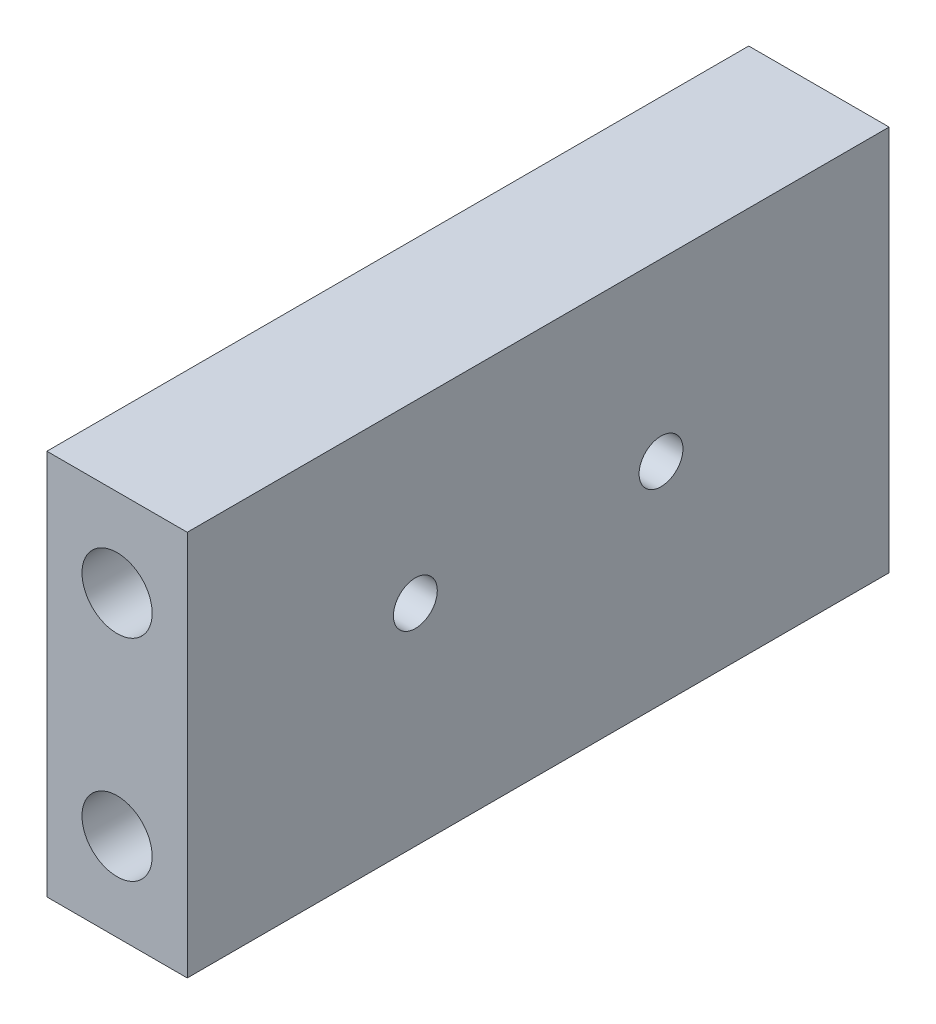
ISO-10303-21;
HEADER;
FILE_DESCRIPTION(('STEP AP214'),'2;1');
FILE_NAME('part.step','',(''),(''),'','','');
FILE_SCHEMA(('AUTOMOTIVE_DESIGN { 1 0 10303 214 1 1 1 1 }'));
ENDSEC;
DATA;
#1=APPLICATION_CONTEXT('core data for automotive mechanical design processes');
#2=APPLICATION_PROTOCOL_DEFINITION('international standard','automotive_design',2000,#1);
#3=PRODUCT_CONTEXT('',#1,'mechanical');
#4=PRODUCT('Part','Part','',(#3));
#5=PRODUCT_RELATED_PRODUCT_CATEGORY('part','',(#4));
#6=PRODUCT_DEFINITION_FORMATION('','',#4);
#7=PRODUCT_DEFINITION_CONTEXT('part definition',#1,'design');
#8=PRODUCT_DEFINITION('design','',#6,#7);
#9=PRODUCT_DEFINITION_SHAPE('','',#8);
#10=(LENGTH_UNIT() NAMED_UNIT(*) SI_UNIT(.MILLI.,.METRE.));
#11=(NAMED_UNIT(*) PLANE_ANGLE_UNIT() SI_UNIT($,.RADIAN.));
#12=(NAMED_UNIT(*) SI_UNIT($,.STERADIAN.) SOLID_ANGLE_UNIT());
#13=UNCERTAINTY_MEASURE_WITH_UNIT(LENGTH_MEASURE(1.E-05),#10,'distance_accuracy_value','');
#14=(GEOMETRIC_REPRESENTATION_CONTEXT(3) GLOBAL_UNCERTAINTY_ASSIGNED_CONTEXT((#13)) GLOBAL_UNIT_ASSIGNED_CONTEXT((#10,
#11,#12)) REPRESENTATION_CONTEXT('',''));
#15=CARTESIAN_POINT('',(0.,0.,0.));
#16=DIRECTION('',(0.,0.,1.));
#17=DIRECTION('',(1.,0.,0.));
#18=AXIS2_PLACEMENT_3D('',#15,#16,#17);
#19=CARTESIAN_POINT('',(25.4,-34.925,-63.5));
#20=DIRECTION('',(0.,0.,1.));
#21=DIRECTION('',(1.,0.,0.));
#22=AXIS2_PLACEMENT_3D('',#19,#20,#21);
#23=PLANE('',#22);
#24=CARTESIAN_POINT('',(12.7,19.05,-63.5));
#25=DIRECTION('',(0.,0.,1.));
#26=DIRECTION('',(1.,0.,0.));
#27=AXIS2_PLACEMENT_3D('',#24,#25,#26);
#28=CIRCLE('',#27,6.35);
#29=CARTESIAN_POINT('',(19.05,19.05,-63.5));
#30=VERTEX_POINT('',#29);
#31=EDGE_CURVE('E127',#30,#30,#28,.T.);
#32=ORIENTED_EDGE('',*,*,#31,.T.);
#33=EDGE_LOOP('',(#32));
#34=FACE_BOUND('',#33,.T.);
#35=DIRECTION('',(0.,1.,0.));
#36=VECTOR('',#35,1.);
#37=CARTESIAN_POINT('',(0.,-34.925,-63.5));
#38=LINE('',#37,#36);
#39=CARTESIAN_POINT('',(0.,-34.925,-63.5));
#40=VERTEX_POINT('',#39);
#41=CARTESIAN_POINT('',(0.,34.925,-63.5));
#42=VERTEX_POINT('',#41);
#43=EDGE_CURVE('E71',#40,#42,#38,.T.);
#44=ORIENTED_EDGE('',*,*,#43,.T.);
#45=DIRECTION('',(-1.,0.,0.));
#46=VECTOR('',#45,1.);
#47=CARTESIAN_POINT('',(25.4,34.925,-63.5));
#48=LINE('',#47,#46);
#49=CARTESIAN_POINT('',(25.4,34.925,-63.5));
#50=VERTEX_POINT('',#49);
#51=EDGE_CURVE('E94',#50,#42,#48,.T.);
#52=ORIENTED_EDGE('',*,*,#51,.F.);
#53=DIRECTION('',(0.,1.,0.));
#54=VECTOR('',#53,1.);
#55=CARTESIAN_POINT('',(25.4,-34.925,-63.5));
#56=LINE('',#55,#54);
#57=CARTESIAN_POINT('',(25.4,-34.925,-63.5));
#58=VERTEX_POINT('',#57);
#59=EDGE_CURVE('E87',#58,#50,#56,.T.);
#60=ORIENTED_EDGE('',*,*,#59,.F.);
#61=DIRECTION('',(-1.,0.,0.));
#62=VECTOR('',#61,1.);
#63=CARTESIAN_POINT('',(25.4,-34.925,-63.5));
#64=LINE('',#63,#62);
#65=EDGE_CURVE('E46',#58,#40,#64,.T.);
#66=ORIENTED_EDGE('',*,*,#65,.T.);
#67=EDGE_LOOP('',(#44,#52,#60,#66));
#68=FACE_BOUND('',#67,.T.);
#69=CARTESIAN_POINT('',(12.7,-19.05,-63.5));
#70=DIRECTION('',(0.,0.,1.));
#71=DIRECTION('',(1.,0.,0.));
#72=AXIS2_PLACEMENT_3D('',#69,#70,#71);
#73=CIRCLE('',#72,6.35);
#74=CARTESIAN_POINT('',(19.05,-19.05,-63.5));
#75=VERTEX_POINT('',#74);
#76=EDGE_CURVE('E133',#75,#75,#73,.T.);
#77=ORIENTED_EDGE('',*,*,#76,.T.);
#78=EDGE_LOOP('',(#77));
#79=FACE_BOUND('',#78,.T.);
#80=ADVANCED_FACE('F37',(#34,#68,#79),#23,.F.);
#81=CARTESIAN_POINT('',(25.4,-34.925,63.5));
#82=DIRECTION('',(0.,0.,-1.));
#83=DIRECTION('',(-1.,0.,0.));
#84=AXIS2_PLACEMENT_3D('',#81,#82,#83);
#85=PLANE('',#84);
#86=CARTESIAN_POINT('',(12.7,-19.05,63.5));
#87=DIRECTION('',(0.,0.,1.));
#88=DIRECTION('',(1.,0.,0.));
#89=AXIS2_PLACEMENT_3D('',#86,#87,#88);
#90=CIRCLE('',#89,6.35);
#91=CARTESIAN_POINT('',(19.05,-19.05,63.5));
#92=VERTEX_POINT('',#91);
#93=EDGE_CURVE('E118',#92,#92,#90,.T.);
#94=ORIENTED_EDGE('',*,*,#93,.F.);
#95=EDGE_LOOP('',(#94));
#96=FACE_BOUND('',#95,.T.);
#97=CARTESIAN_POINT('',(12.7,19.05,63.5));
#98=DIRECTION('',(0.,0.,1.));
#99=DIRECTION('',(1.,0.,0.));
#100=AXIS2_PLACEMENT_3D('',#97,#98,#99);
#101=CIRCLE('',#100,6.35);
#102=CARTESIAN_POINT('',(19.05,19.05,63.5));
#103=VERTEX_POINT('',#102);
#104=EDGE_CURVE('E115',#103,#103,#101,.T.);
#105=ORIENTED_EDGE('',*,*,#104,.F.);
#106=EDGE_LOOP('',(#105));
#107=FACE_BOUND('',#106,.T.);
#108=DIRECTION('',(0.,-1.,0.));
#109=VECTOR('',#108,1.);
#110=CARTESIAN_POINT('',(0.,-34.925,63.5));
#111=LINE('',#110,#109);
#112=CARTESIAN_POINT('',(0.,34.925,63.5));
#113=VERTEX_POINT('',#112);
#114=CARTESIAN_POINT('',(0.,-34.925,63.5));
#115=VERTEX_POINT('',#114);
#116=EDGE_CURVE('E101',#113,#115,#111,.T.);
#117=ORIENTED_EDGE('',*,*,#116,.T.);
#118=DIRECTION('',(-1.,0.,0.));
#119=VECTOR('',#118,1.);
#120=CARTESIAN_POINT('',(25.4,-34.925,63.5));
#121=LINE('',#120,#119);
#122=CARTESIAN_POINT('',(25.4,-34.925,63.5));
#123=VERTEX_POINT('',#122);
#124=EDGE_CURVE('E11',#123,#115,#121,.T.);
#125=ORIENTED_EDGE('',*,*,#124,.F.);
#126=DIRECTION('',(0.,-1.,0.));
#127=VECTOR('',#126,1.);
#128=CARTESIAN_POINT('',(25.4,-34.925,63.5));
#129=LINE('',#128,#127);
#130=CARTESIAN_POINT('',(25.4,34.925,63.5));
#131=VERTEX_POINT('',#130);
#132=EDGE_CURVE('E89',#131,#123,#129,.T.);
#133=ORIENTED_EDGE('',*,*,#132,.F.);
#134=DIRECTION('',(-1.,0.,0.));
#135=VECTOR('',#134,1.);
#136=CARTESIAN_POINT('',(25.4,34.925,63.5));
#137=LINE('',#136,#135);
#138=EDGE_CURVE('E97',#131,#113,#137,.T.);
#139=ORIENTED_EDGE('',*,*,#138,.T.);
#140=EDGE_LOOP('',(#117,#125,#133,#139));
#141=FACE_BOUND('',#140,.T.);
#142=ADVANCED_FACE('F39',(#96,#107,#141),#85,.F.);
#143=CARTESIAN_POINT('',(25.4,-34.925,-63.5));
#144=DIRECTION('',(0.,1.,0.));
#145=DIRECTION('',(0.,0.,1.));
#146=AXIS2_PLACEMENT_3D('',#143,#144,#145);
#147=PLANE('',#146);
#148=DIRECTION('',(0.,0.,-1.));
#149=VECTOR('',#148,1.);
#150=CARTESIAN_POINT('',(0.,-34.925,-63.5));
#151=LINE('',#150,#149);
#152=EDGE_CURVE('E93',#115,#40,#151,.T.);
#153=ORIENTED_EDGE('',*,*,#152,.T.);
#154=ORIENTED_EDGE('',*,*,#65,.F.);
#155=DIRECTION('',(0.,0.,-1.));
#156=VECTOR('',#155,1.);
#157=CARTESIAN_POINT('',(25.4,-34.925,-63.5));
#158=LINE('',#157,#156);
#159=EDGE_CURVE('E84',#123,#58,#158,.T.);
#160=ORIENTED_EDGE('',*,*,#159,.F.);
#161=ORIENTED_EDGE('',*,*,#124,.T.);
#162=EDGE_LOOP('',(#153,#154,#160,#161));
#163=FACE_BOUND('',#162,.T.);
#164=ADVANCED_FACE('F92',(#163),#147,.F.);
#165=CARTESIAN_POINT('',(25.4,34.925,-63.5));
#166=DIRECTION('',(0.,-1.,0.));
#167=DIRECTION('',(0.,0.,-1.));
#168=AXIS2_PLACEMENT_3D('',#165,#166,#167);
#169=PLANE('',#168);
#170=DIRECTION('',(0.,0.,1.));
#171=VECTOR('',#170,1.);
#172=CARTESIAN_POINT('',(0.,34.925,-63.5));
#173=LINE('',#172,#171);
#174=EDGE_CURVE('E77',#42,#113,#173,.T.);
#175=ORIENTED_EDGE('',*,*,#174,.T.);
#176=ORIENTED_EDGE('',*,*,#138,.F.);
#177=DIRECTION('',(0.,0.,1.));
#178=VECTOR('',#177,1.);
#179=CARTESIAN_POINT('',(25.4,34.925,-63.5));
#180=LINE('',#179,#178);
#181=EDGE_CURVE('E54',#50,#131,#180,.T.);
#182=ORIENTED_EDGE('',*,*,#181,.F.);
#183=ORIENTED_EDGE('',*,*,#51,.T.);
#184=EDGE_LOOP('',(#175,#176,#182,#183));
#185=FACE_BOUND('',#184,.T.);
#186=ADVANCED_FACE('F109',(#185),#169,.F.);
#187=CARTESIAN_POINT('',(25.4,0.,0.));
#188=DIRECTION('',(1.,0.,0.));
#189=DIRECTION('',(0.,0.,-1.));
#190=AXIS2_PLACEMENT_3D('',#187,#188,#189);
#191=PLANE('',#190);
#192=CARTESIAN_POINT('',(25.4,3.17500000000003,-22.225));
#193=DIRECTION('',(1.,0.,0.));
#194=DIRECTION('',(0.,0.,-1.));
#195=AXIS2_PLACEMENT_3D('',#192,#193,#194);
#196=CIRCLE('',#195,3.96875);
#197=CARTESIAN_POINT('',(25.4,3.17500000000003,-26.19375));
#198=VERTEX_POINT('',#197);
#199=EDGE_CURVE('E145',#198,#198,#196,.T.);
#200=ORIENTED_EDGE('',*,*,#199,.F.);
#201=EDGE_LOOP('',(#200));
#202=FACE_BOUND('',#201,.T.);
#203=CARTESIAN_POINT('',(25.4,3.17500000000001,22.225));
#204=DIRECTION('',(1.,0.,0.));
#205=DIRECTION('',(0.,0.,-1.));
#206=AXIS2_PLACEMENT_3D('',#203,#204,#205);
#207=CIRCLE('',#206,3.96875);
#208=CARTESIAN_POINT('',(25.4,3.17500000000001,18.25625));
#209=VERTEX_POINT('',#208);
#210=EDGE_CURVE('E139',#209,#209,#207,.T.);
#211=ORIENTED_EDGE('',*,*,#210,.F.);
#212=EDGE_LOOP('',(#211));
#213=FACE_BOUND('',#212,.T.);
#214=ORIENTED_EDGE('',*,*,#132,.T.);
#215=ORIENTED_EDGE('',*,*,#159,.T.);
#216=ORIENTED_EDGE('',*,*,#59,.T.);
#217=ORIENTED_EDGE('',*,*,#181,.T.);
#218=EDGE_LOOP('',(#214,#215,#216,#217));
#219=FACE_BOUND('',#218,.T.);
#220=ADVANCED_FACE('F85',(#202,#213,#219),#191,.T.);
#221=CARTESIAN_POINT('',(0.,0.,0.));
#222=DIRECTION('',(1.,0.,0.));
#223=DIRECTION('',(0.,0.,-1.));
#224=AXIS2_PLACEMENT_3D('',#221,#222,#223);
#225=PLANE('',#224);
#226=CARTESIAN_POINT('',(0.,3.17500000000003,-22.225));
#227=DIRECTION('',(1.,0.,0.));
#228=DIRECTION('',(0.,0.,-1.));
#229=AXIS2_PLACEMENT_3D('',#226,#227,#228);
#230=CIRCLE('',#229,3.96875);
#231=CARTESIAN_POINT('',(0.,3.17500000000003,-26.19375));
#232=VERTEX_POINT('',#231);
#233=EDGE_CURVE('E142',#232,#232,#230,.T.);
#234=ORIENTED_EDGE('',*,*,#233,.T.);
#235=EDGE_LOOP('',(#234));
#236=FACE_BOUND('',#235,.T.);
#237=CARTESIAN_POINT('',(0.,3.17500000000001,22.225));
#238=DIRECTION('',(1.,0.,0.));
#239=DIRECTION('',(0.,0.,-1.));
#240=AXIS2_PLACEMENT_3D('',#237,#238,#239);
#241=CIRCLE('',#240,3.96875);
#242=CARTESIAN_POINT('',(0.,3.17500000000001,18.25625));
#243=VERTEX_POINT('',#242);
#244=EDGE_CURVE('E136',#243,#243,#241,.T.);
#245=ORIENTED_EDGE('',*,*,#244,.T.);
#246=EDGE_LOOP('',(#245));
#247=FACE_BOUND('',#246,.T.);
#248=ORIENTED_EDGE('',*,*,#116,.F.);
#249=ORIENTED_EDGE('',*,*,#174,.F.);
#250=ORIENTED_EDGE('',*,*,#43,.F.);
#251=ORIENTED_EDGE('',*,*,#152,.F.);
#252=EDGE_LOOP('',(#248,#249,#250,#251));
#253=FACE_BOUND('',#252,.T.);
#254=ADVANCED_FACE('F112',(#236,#247,#253),#225,.F.);
#255=CARTESIAN_POINT('',(12.7,19.05,38.1));
#256=DIRECTION('',(0.,0.,1.));
#257=DIRECTION('',(1.,0.,0.));
#258=AXIS2_PLACEMENT_3D('',#255,#256,#257);
#259=CYLINDRICAL_SURFACE('',#258,6.35);
#260=CARTESIAN_POINT('',(12.7,19.05,38.1));
#261=DIRECTION('',(0.,0.,1.));
#262=DIRECTION('',(1.,0.,0.));
#263=AXIS2_PLACEMENT_3D('',#260,#261,#262);
#264=CIRCLE('',#263,6.35);
#265=CARTESIAN_POINT('',(19.05,19.05,38.1));
#266=VERTEX_POINT('',#265);
#267=EDGE_CURVE('E104',#266,#266,#264,.T.);
#268=ORIENTED_EDGE('',*,*,#267,.F.);
#269=EDGE_LOOP('',(#268));
#270=FACE_BOUND('',#269,.T.);
#271=ORIENTED_EDGE('',*,*,#104,.T.);
#272=EDGE_LOOP('',(#271));
#273=FACE_BOUND('',#272,.T.);
#274=ADVANCED_FACE('F206',(#270,#273),#259,.F.);
#275=CARTESIAN_POINT('',(12.7,19.05,38.1));
#276=DIRECTION('',(0.,0.,1.));
#277=DIRECTION('',(1.,0.,0.));
#278=AXIS2_PLACEMENT_3D('',#275,#276,#277);
#279=PLANE('',#278);
#280=ORIENTED_EDGE('',*,*,#267,.T.);
#281=EDGE_LOOP('',(#280));
#282=FACE_BOUND('',#281,.T.);
#283=ADVANCED_FACE('F214',(#282),#279,.T.);
#284=CARTESIAN_POINT('',(12.7,-19.05,38.1));
#285=DIRECTION('',(0.,0.,1.));
#286=DIRECTION('',(1.,0.,0.));
#287=AXIS2_PLACEMENT_3D('',#284,#285,#286);
#288=CYLINDRICAL_SURFACE('',#287,6.35);
#289=CARTESIAN_POINT('',(12.7,-19.05,38.1));
#290=DIRECTION('',(0.,0.,1.));
#291=DIRECTION('',(1.,0.,0.));
#292=AXIS2_PLACEMENT_3D('',#289,#290,#291);
#293=CIRCLE('',#292,6.35);
#294=CARTESIAN_POINT('',(19.05,-19.05,38.1));
#295=VERTEX_POINT('',#294);
#296=EDGE_CURVE('E121',#295,#295,#293,.T.);
#297=ORIENTED_EDGE('',*,*,#296,.F.);
#298=EDGE_LOOP('',(#297));
#299=FACE_BOUND('',#298,.T.);
#300=ORIENTED_EDGE('',*,*,#93,.T.);
#301=EDGE_LOOP('',(#300));
#302=FACE_BOUND('',#301,.T.);
#303=ADVANCED_FACE('F221',(#299,#302),#288,.F.);
#304=CARTESIAN_POINT('',(12.7,-19.05,38.1));
#305=DIRECTION('',(0.,0.,1.));
#306=DIRECTION('',(1.,0.,0.));
#307=AXIS2_PLACEMENT_3D('',#304,#305,#306);
#308=PLANE('',#307);
#309=ORIENTED_EDGE('',*,*,#296,.T.);
#310=EDGE_LOOP('',(#309));
#311=FACE_BOUND('',#310,.T.);
#312=ADVANCED_FACE('F229',(#311),#308,.T.);
#313=CARTESIAN_POINT('',(12.7,19.05,-38.1));
#314=DIRECTION('',(0.,0.,-1.));
#315=DIRECTION('',(-1.,0.,0.));
#316=AXIS2_PLACEMENT_3D('',#313,#314,#315);
#317=CYLINDRICAL_SURFACE('',#316,6.35);
#318=CARTESIAN_POINT('',(12.7,19.05,-38.1));
#319=DIRECTION('',(0.,0.,1.));
#320=DIRECTION('',(1.,0.,0.));
#321=AXIS2_PLACEMENT_3D('',#318,#319,#320);
#322=CIRCLE('',#321,6.35);
#323=CARTESIAN_POINT('',(19.05,19.05,-38.1));
#324=VERTEX_POINT('',#323);
#325=EDGE_CURVE('E124',#324,#324,#322,.T.);
#326=ORIENTED_EDGE('',*,*,#325,.T.);
#327=EDGE_LOOP('',(#326));
#328=FACE_BOUND('',#327,.T.);
#329=ORIENTED_EDGE('',*,*,#31,.F.);
#330=EDGE_LOOP('',(#329));
#331=FACE_BOUND('',#330,.T.);
#332=ADVANCED_FACE('F237',(#328,#331),#317,.F.);
#333=CARTESIAN_POINT('',(12.7,19.05,-38.1));
#334=DIRECTION('',(0.,0.,-1.));
#335=DIRECTION('',(1.,0.,0.));
#336=AXIS2_PLACEMENT_3D('',#333,#334,#335);
#337=PLANE('',#336);
#338=ORIENTED_EDGE('',*,*,#325,.F.);
#339=EDGE_LOOP('',(#338));
#340=FACE_BOUND('',#339,.T.);
#341=ADVANCED_FACE('F245',(#340),#337,.T.);
#342=CARTESIAN_POINT('',(12.7,-19.05,-38.1));
#343=DIRECTION('',(0.,0.,-1.));
#344=DIRECTION('',(-1.,0.,0.));
#345=AXIS2_PLACEMENT_3D('',#342,#343,#344);
#346=CYLINDRICAL_SURFACE('',#345,6.35);
#347=CARTESIAN_POINT('',(12.7,-19.05,-38.1));
#348=DIRECTION('',(0.,0.,1.));
#349=DIRECTION('',(1.,0.,0.));
#350=AXIS2_PLACEMENT_3D('',#347,#348,#349);
#351=CIRCLE('',#350,6.35);
#352=CARTESIAN_POINT('',(19.05,-19.05,-38.1));
#353=VERTEX_POINT('',#352);
#354=EDGE_CURVE('E130',#353,#353,#351,.T.);
#355=ORIENTED_EDGE('',*,*,#354,.T.);
#356=EDGE_LOOP('',(#355));
#357=FACE_BOUND('',#356,.T.);
#358=ORIENTED_EDGE('',*,*,#76,.F.);
#359=EDGE_LOOP('',(#358));
#360=FACE_BOUND('',#359,.T.);
#361=ADVANCED_FACE('F172',(#357,#360),#346,.F.);
#362=CARTESIAN_POINT('',(12.7,-19.05,-38.1));
#363=DIRECTION('',(0.,0.,-1.));
#364=DIRECTION('',(1.,0.,0.));
#365=AXIS2_PLACEMENT_3D('',#362,#363,#364);
#366=PLANE('',#365);
#367=ORIENTED_EDGE('',*,*,#354,.F.);
#368=EDGE_LOOP('',(#367));
#369=FACE_BOUND('',#368,.T.);
#370=ADVANCED_FACE('F166',(#369),#366,.T.);
#371=CARTESIAN_POINT('',(0.,3.17500000000001,22.225));
#372=DIRECTION('',(1.,0.,0.));
#373=DIRECTION('',(0.,0.,-1.));
#374=AXIS2_PLACEMENT_3D('',#371,#372,#373);
#375=CYLINDRICAL_SURFACE('',#374,3.96875);
#376=ORIENTED_EDGE('',*,*,#244,.F.);
#377=EDGE_LOOP('',(#376));
#378=FACE_BOUND('',#377,.T.);
#379=ORIENTED_EDGE('',*,*,#210,.T.);
#380=EDGE_LOOP('',(#379));
#381=FACE_BOUND('',#380,.T.);
#382=ADVANCED_FACE('F156',(#378,#381),#375,.F.);
#383=CARTESIAN_POINT('',(0.,3.17500000000003,-22.225));
#384=DIRECTION('',(1.,0.,0.));
#385=DIRECTION('',(0.,0.,-1.));
#386=AXIS2_PLACEMENT_3D('',#383,#384,#385);
#387=CYLINDRICAL_SURFACE('',#386,3.96875);
#388=ORIENTED_EDGE('',*,*,#233,.F.);
#389=EDGE_LOOP('',(#388));
#390=FACE_BOUND('',#389,.T.);
#391=ORIENTED_EDGE('',*,*,#199,.T.);
#392=EDGE_LOOP('',(#391));
#393=FACE_BOUND('',#392,.T.);
#394=ADVANCED_FACE('F153',(#390,#393),#387,.F.);
#395=CLOSED_SHELL('',(#80,#142,#164,#186,#220,#254,#274,#283,#303,#312,#332,#341,#361,#370,#382,#394));
#396=MANIFOLD_SOLID_BREP('B2',#395);
#397=ADVANCED_BREP_SHAPE_REPRESENTATION('',(#18,#396),#14);
#398=SHAPE_DEFINITION_REPRESENTATION(#9,#397);
ENDSEC;
END-ISO-10303-21;
